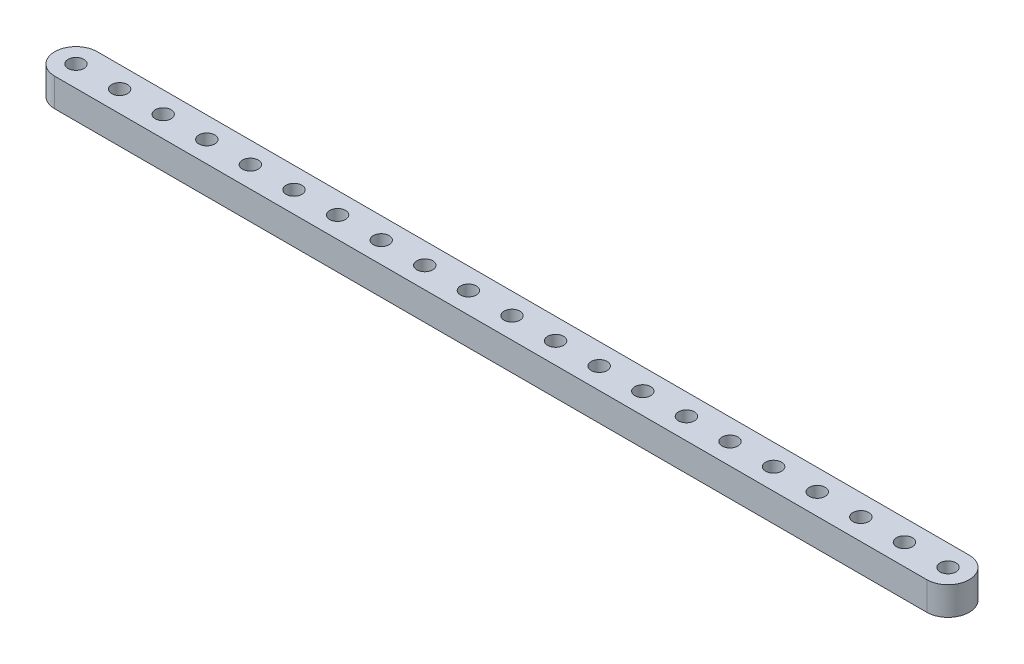
ISO-10303-21;
HEADER;
FILE_DESCRIPTION(('STEP AP214'),'2;1');
FILE_NAME('part.step','',(''),(''),'','','');
FILE_SCHEMA(('AUTOMOTIVE_DESIGN { 1 0 10303 214 1 1 1 1 }'));
ENDSEC;
DATA;
#1=APPLICATION_CONTEXT('core data for automotive mechanical design processes');
#2=APPLICATION_PROTOCOL_DEFINITION('international standard','automotive_design',2000,#1);
#3=PRODUCT_CONTEXT('',#1,'mechanical');
#4=PRODUCT('Part','Part','',(#3));
#5=PRODUCT_RELATED_PRODUCT_CATEGORY('part','',(#4));
#6=PRODUCT_DEFINITION_FORMATION('','',#4);
#7=PRODUCT_DEFINITION_CONTEXT('part definition',#1,'design');
#8=PRODUCT_DEFINITION('design','',#6,#7);
#9=PRODUCT_DEFINITION_SHAPE('','',#8);
#10=(LENGTH_UNIT() NAMED_UNIT(*) SI_UNIT(.MILLI.,.METRE.));
#11=(NAMED_UNIT(*) PLANE_ANGLE_UNIT() SI_UNIT($,.RADIAN.));
#12=(NAMED_UNIT(*) SI_UNIT($,.STERADIAN.) SOLID_ANGLE_UNIT());
#13=UNCERTAINTY_MEASURE_WITH_UNIT(LENGTH_MEASURE(1.E-05),#10,'distance_accuracy_value','');
#14=(GEOMETRIC_REPRESENTATION_CONTEXT(3) GLOBAL_UNCERTAINTY_ASSIGNED_CONTEXT((#13)) GLOBAL_UNIT_ASSIGNED_CONTEXT((#10,
#11,#12)) REPRESENTATION_CONTEXT('',''));
#15=CARTESIAN_POINT('',(0.,0.,0.));
#16=DIRECTION('',(0.,0.,1.));
#17=DIRECTION('',(1.,0.,0.));
#18=AXIS2_PLACEMENT_3D('',#15,#16,#17);
#19=CARTESIAN_POINT('',(97.79,0.,0.));
#20=DIRECTION('',(0.,1.,0.));
#21=DIRECTION('',(0.,0.,1.));
#22=AXIS2_PLACEMENT_3D('',#19,#20,#21);
#23=CYLINDRICAL_SURFACE('',#22,4.76250000000002);
#24=CARTESIAN_POINT('',(97.79,6.35,0.));
#25=DIRECTION('',(0.,1.,0.));
#26=DIRECTION('',(0.,0.,1.));
#27=AXIS2_PLACEMENT_3D('',#24,#25,#26);
#28=CIRCLE('',#27,4.76250000000002);
#29=CARTESIAN_POINT('',(97.79,6.35,4.76250000000003));
#30=VERTEX_POINT('',#29);
#31=CARTESIAN_POINT('',(97.79,6.35,-4.76250000000002));
#32=VERTEX_POINT('',#31);
#33=EDGE_CURVE('E98',#30,#32,#28,.T.);
#34=ORIENTED_EDGE('',*,*,#33,.F.);
#35=DIRECTION('',(0.,1.,0.));
#36=VECTOR('',#35,1.);
#37=CARTESIAN_POINT('',(97.79,0.,4.76250000000003));
#38=LINE('',#37,#36);
#39=CARTESIAN_POINT('',(97.79,0.,4.76250000000003));
#40=VERTEX_POINT('',#39);
#41=EDGE_CURVE('E11',#40,#30,#38,.T.);
#42=ORIENTED_EDGE('',*,*,#41,.F.);
#43=CARTESIAN_POINT('',(97.79,0.,0.));
#44=DIRECTION('',(0.,1.,0.));
#45=DIRECTION('',(0.,0.,1.));
#46=AXIS2_PLACEMENT_3D('',#43,#44,#45);
#47=CIRCLE('',#46,4.76250000000002);
#48=CARTESIAN_POINT('',(97.79,0.,-4.76250000000002));
#49=VERTEX_POINT('',#48);
#50=EDGE_CURVE('E91',#40,#49,#47,.T.);
#51=ORIENTED_EDGE('',*,*,#50,.T.);
#52=DIRECTION('',(0.,1.,0.));
#53=VECTOR('',#52,1.);
#54=CARTESIAN_POINT('',(97.79,0.,-4.76250000000002));
#55=LINE('',#54,#53);
#56=EDGE_CURVE('E36',#49,#32,#55,.T.);
#57=ORIENTED_EDGE('',*,*,#56,.T.);
#58=EDGE_LOOP('',(#34,#42,#51,#57));
#59=FACE_BOUND('',#58,.T.);
#60=ADVANCED_FACE('F33',(#59),#23,.T.);
#61=CARTESIAN_POINT('',(-97.79,0.,4.76250000000003));
#62=DIRECTION('',(0.,0.,1.));
#63=DIRECTION('',(1.,0.,0.));
#64=AXIS2_PLACEMENT_3D('',#61,#62,#63);
#65=PLANE('',#64);
#66=DIRECTION('',(1.,0.,0.));
#67=VECTOR('',#66,1.);
#68=CARTESIAN_POINT('',(-97.79,6.35,4.76250000000003));
#69=LINE('',#68,#67);
#70=CARTESIAN_POINT('',(-97.79,6.35,4.76250000000003));
#71=VERTEX_POINT('',#70);
#72=EDGE_CURVE('E93',#71,#30,#69,.T.);
#73=ORIENTED_EDGE('',*,*,#72,.F.);
#74=DIRECTION('',(0.,1.,0.));
#75=VECTOR('',#74,1.);
#76=CARTESIAN_POINT('',(-97.79,0.,4.76250000000003));
#77=LINE('',#76,#75);
#78=CARTESIAN_POINT('',(-97.79,0.,4.76250000000003));
#79=VERTEX_POINT('',#78);
#80=EDGE_CURVE('E42',#79,#71,#77,.T.);
#81=ORIENTED_EDGE('',*,*,#80,.F.);
#82=DIRECTION('',(1.,0.,0.));
#83=VECTOR('',#82,1.);
#84=CARTESIAN_POINT('',(-97.79,0.,4.76250000000003));
#85=LINE('',#84,#83);
#86=EDGE_CURVE('E88',#79,#40,#85,.T.);
#87=ORIENTED_EDGE('',*,*,#86,.T.);
#88=ORIENTED_EDGE('',*,*,#41,.T.);
#89=EDGE_LOOP('',(#73,#81,#87,#88));
#90=FACE_BOUND('',#89,.T.);
#91=ADVANCED_FACE('F109',(#90),#65,.T.);
#92=CARTESIAN_POINT('',(-97.79,0.,0.));
#93=DIRECTION('',(0.,1.,0.));
#94=DIRECTION('',(0.,0.,1.));
#95=AXIS2_PLACEMENT_3D('',#92,#93,#94);
#96=CYLINDRICAL_SURFACE('',#95,4.76250000000002);
#97=CARTESIAN_POINT('',(-97.79,6.35,0.));
#98=DIRECTION('',(0.,1.,0.));
#99=DIRECTION('',(0.,0.,1.));
#100=AXIS2_PLACEMENT_3D('',#97,#98,#99);
#101=CIRCLE('',#100,4.76250000000002);
#102=CARTESIAN_POINT('',(-97.79,6.35,-4.7625));
#103=VERTEX_POINT('',#102);
#104=EDGE_CURVE('E83',#103,#71,#101,.T.);
#105=ORIENTED_EDGE('',*,*,#104,.F.);
#106=DIRECTION('',(0.,1.,0.));
#107=VECTOR('',#106,1.);
#108=CARTESIAN_POINT('',(-97.79,0.,-4.7625));
#109=LINE('',#108,#107);
#110=CARTESIAN_POINT('',(-97.79,0.,-4.7625));
#111=VERTEX_POINT('',#110);
#112=EDGE_CURVE('E78',#111,#103,#109,.T.);
#113=ORIENTED_EDGE('',*,*,#112,.F.);
#114=CARTESIAN_POINT('',(-97.79,0.,0.));
#115=DIRECTION('',(0.,1.,0.));
#116=DIRECTION('',(0.,0.,1.));
#117=AXIS2_PLACEMENT_3D('',#114,#115,#116);
#118=CIRCLE('',#117,4.76250000000002);
#119=EDGE_CURVE('E81',#111,#79,#118,.T.);
#120=ORIENTED_EDGE('',*,*,#119,.T.);
#121=ORIENTED_EDGE('',*,*,#80,.T.);
#122=EDGE_LOOP('',(#105,#113,#120,#121));
#123=FACE_BOUND('',#122,.T.);
#124=ADVANCED_FACE('F80',(#123),#96,.T.);
#125=CARTESIAN_POINT('',(97.79,0.,-4.76250000000002));
#126=DIRECTION('',(0.,0.,-1.));
#127=DIRECTION('',(-1.,0.,0.));
#128=AXIS2_PLACEMENT_3D('',#125,#126,#127);
#129=PLANE('',#128);
#130=DIRECTION('',(-1.,0.,0.));
#131=VECTOR('',#130,1.);
#132=CARTESIAN_POINT('',(97.79,6.35,-4.76250000000002));
#133=LINE('',#132,#131);
#134=EDGE_CURVE('E101',#32,#103,#133,.T.);
#135=ORIENTED_EDGE('',*,*,#134,.F.);
#136=ORIENTED_EDGE('',*,*,#56,.F.);
#137=DIRECTION('',(-1.,0.,0.));
#138=VECTOR('',#137,1.);
#139=CARTESIAN_POINT('',(97.79,0.,-4.76250000000002));
#140=LINE('',#139,#138);
#141=EDGE_CURVE('E87',#49,#111,#140,.T.);
#142=ORIENTED_EDGE('',*,*,#141,.T.);
#143=ORIENTED_EDGE('',*,*,#112,.T.);
#144=EDGE_LOOP('',(#135,#136,#142,#143));
#145=FACE_BOUND('',#144,.T.);
#146=ADVANCED_FACE('F90',(#145),#129,.T.);
#147=CARTESIAN_POINT('',(97.79,0.,0.));
#148=DIRECTION('',(0.,1.,0.));
#149=DIRECTION('',(0.,0.,1.));
#150=AXIS2_PLACEMENT_3D('',#147,#148,#149);
#151=PLANE('',#150);
#152=CARTESIAN_POINT('',(-97.79,0.,0.));
#153=DIRECTION('',(0.,1.,0.));
#154=DIRECTION('',(0.,0.,-1.));
#155=AXIS2_PLACEMENT_3D('',#152,#153,#154);
#156=CIRCLE('',#155,1.77799999999997);
#157=CARTESIAN_POINT('',(-97.79,0.,-1.77799999999995));
#158=VERTEX_POINT('',#157);
#159=EDGE_CURVE('E218',#158,#158,#156,.T.);
#160=ORIENTED_EDGE('',*,*,#159,.T.);
#161=EDGE_LOOP('',(#160));
#162=FACE_BOUND('',#161,.T.);
#163=CARTESIAN_POINT('',(-88.011,0.,0.));
#164=DIRECTION('',(0.,1.,0.));
#165=DIRECTION('',(0.,0.,-1.));
#166=AXIS2_PLACEMENT_3D('',#163,#164,#165);
#167=CIRCLE('',#166,1.77799999999999);
#168=CARTESIAN_POINT('',(-88.011,0.,-1.77799999999999));
#169=VERTEX_POINT('',#168);
#170=EDGE_CURVE('E226',#169,#169,#167,.T.);
#171=ORIENTED_EDGE('',*,*,#170,.T.);
#172=EDGE_LOOP('',(#171));
#173=FACE_BOUND('',#172,.T.);
#174=CARTESIAN_POINT('',(-78.232,0.,0.));
#175=DIRECTION('',(0.,1.,0.));
#176=DIRECTION('',(0.,0.,-1.));
#177=AXIS2_PLACEMENT_3D('',#174,#175,#176);
#178=CIRCLE('',#177,1.77799999999999);
#179=CARTESIAN_POINT('',(-78.232,0.,-1.77799999999999));
#180=VERTEX_POINT('',#179);
#181=EDGE_CURVE('E232',#180,#180,#178,.T.);
#182=ORIENTED_EDGE('',*,*,#181,.T.);
#183=EDGE_LOOP('',(#182));
#184=FACE_BOUND('',#183,.T.);
#185=CARTESIAN_POINT('',(-68.453,0.,0.));
#186=DIRECTION('',(0.,1.,0.));
#187=DIRECTION('',(0.,0.,-1.));
#188=AXIS2_PLACEMENT_3D('',#185,#186,#187);
#189=CIRCLE('',#188,1.77799999999999);
#190=CARTESIAN_POINT('',(-68.453,0.,-1.77799999999999));
#191=VERTEX_POINT('',#190);
#192=EDGE_CURVE('E238',#191,#191,#189,.T.);
#193=ORIENTED_EDGE('',*,*,#192,.T.);
#194=EDGE_LOOP('',(#193));
#195=FACE_BOUND('',#194,.T.);
#196=CARTESIAN_POINT('',(-58.674,0.,0.));
#197=DIRECTION('',(0.,1.,0.));
#198=DIRECTION('',(0.,0.,-1.));
#199=AXIS2_PLACEMENT_3D('',#196,#197,#198);
#200=CIRCLE('',#199,1.77799999999999);
#201=CARTESIAN_POINT('',(-58.674,0.,-1.77799999999998));
#202=VERTEX_POINT('',#201);
#203=EDGE_CURVE('E244',#202,#202,#200,.T.);
#204=ORIENTED_EDGE('',*,*,#203,.T.);
#205=EDGE_LOOP('',(#204));
#206=FACE_BOUND('',#205,.T.);
#207=CARTESIAN_POINT('',(-48.895,0.,0.));
#208=DIRECTION('',(0.,1.,0.));
#209=DIRECTION('',(0.,0.,-1.));
#210=AXIS2_PLACEMENT_3D('',#207,#208,#209);
#211=CIRCLE('',#210,1.77799999999999);
#212=CARTESIAN_POINT('',(-48.895,0.,-1.77799999999998));
#213=VERTEX_POINT('',#212);
#214=EDGE_CURVE('E250',#213,#213,#211,.T.);
#215=ORIENTED_EDGE('',*,*,#214,.T.);
#216=EDGE_LOOP('',(#215));
#217=FACE_BOUND('',#216,.T.);
#218=CARTESIAN_POINT('',(-39.116,0.,0.));
#219=DIRECTION('',(0.,1.,0.));
#220=DIRECTION('',(0.,0.,-1.));
#221=AXIS2_PLACEMENT_3D('',#218,#219,#220);
#222=CIRCLE('',#221,1.77799999999999);
#223=CARTESIAN_POINT('',(-39.116,0.,-1.77799999999998));
#224=VERTEX_POINT('',#223);
#225=EDGE_CURVE('E256',#224,#224,#222,.T.);
#226=ORIENTED_EDGE('',*,*,#225,.T.);
#227=EDGE_LOOP('',(#226));
#228=FACE_BOUND('',#227,.T.);
#229=CARTESIAN_POINT('',(-29.337,0.,0.));
#230=DIRECTION('',(0.,1.,0.));
#231=DIRECTION('',(0.,0.,-1.));
#232=AXIS2_PLACEMENT_3D('',#229,#230,#231);
#233=CIRCLE('',#232,1.77799999999999);
#234=CARTESIAN_POINT('',(-29.337,0.,-1.77799999999998));
#235=VERTEX_POINT('',#234);
#236=EDGE_CURVE('E262',#235,#235,#233,.T.);
#237=ORIENTED_EDGE('',*,*,#236,.T.);
#238=EDGE_LOOP('',(#237));
#239=FACE_BOUND('',#238,.T.);
#240=CARTESIAN_POINT('',(-19.558,0.,0.));
#241=DIRECTION('',(0.,1.,0.));
#242=DIRECTION('',(0.,0.,-1.));
#243=AXIS2_PLACEMENT_3D('',#240,#241,#242);
#244=CIRCLE('',#243,1.77799999999999);
#245=CARTESIAN_POINT('',(-19.558,0.,-1.77799999999998));
#246=VERTEX_POINT('',#245);
#247=EDGE_CURVE('E268',#246,#246,#244,.T.);
#248=ORIENTED_EDGE('',*,*,#247,.T.);
#249=EDGE_LOOP('',(#248));
#250=FACE_BOUND('',#249,.T.);
#251=CARTESIAN_POINT('',(-9.77900000000001,0.,0.));
#252=DIRECTION('',(0.,1.,0.));
#253=DIRECTION('',(0.,0.,-1.));
#254=AXIS2_PLACEMENT_3D('',#251,#252,#253);
#255=CIRCLE('',#254,1.77799999999999);
#256=CARTESIAN_POINT('',(-9.77900000000001,0.,-1.77799999999998));
#257=VERTEX_POINT('',#256);
#258=EDGE_CURVE('E274',#257,#257,#255,.T.);
#259=ORIENTED_EDGE('',*,*,#258,.T.);
#260=EDGE_LOOP('',(#259));
#261=FACE_BOUND('',#260,.T.);
#262=CARTESIAN_POINT('',(0.,0.,0.));
#263=DIRECTION('',(0.,1.,0.));
#264=DIRECTION('',(0.,0.,-1.));
#265=AXIS2_PLACEMENT_3D('',#262,#263,#264);
#266=CIRCLE('',#265,1.77799999999999);
#267=CARTESIAN_POINT('',(0.,0.,-1.77799999999998));
#268=VERTEX_POINT('',#267);
#269=EDGE_CURVE('E280',#268,#268,#266,.T.);
#270=ORIENTED_EDGE('',*,*,#269,.T.);
#271=EDGE_LOOP('',(#270));
#272=FACE_BOUND('',#271,.T.);
#273=CARTESIAN_POINT('',(9.779,0.,0.));
#274=DIRECTION('',(0.,1.,0.));
#275=DIRECTION('',(0.,0.,-1.));
#276=AXIS2_PLACEMENT_3D('',#273,#274,#275);
#277=CIRCLE('',#276,1.77799999999999);
#278=CARTESIAN_POINT('',(9.779,0.,-1.77799999999998));
#279=VERTEX_POINT('',#278);
#280=EDGE_CURVE('E286',#279,#279,#277,.T.);
#281=ORIENTED_EDGE('',*,*,#280,.T.);
#282=EDGE_LOOP('',(#281));
#283=FACE_BOUND('',#282,.T.);
#284=CARTESIAN_POINT('',(19.558,0.,0.));
#285=DIRECTION('',(0.,1.,0.));
#286=DIRECTION('',(0.,0.,-1.));
#287=AXIS2_PLACEMENT_3D('',#284,#285,#286);
#288=CIRCLE('',#287,1.77799999999999);
#289=CARTESIAN_POINT('',(19.558,0.,-1.77799999999998));
#290=VERTEX_POINT('',#289);
#291=EDGE_CURVE('E292',#290,#290,#288,.T.);
#292=ORIENTED_EDGE('',*,*,#291,.T.);
#293=EDGE_LOOP('',(#292));
#294=FACE_BOUND('',#293,.T.);
#295=CARTESIAN_POINT('',(29.337,0.,0.));
#296=DIRECTION('',(0.,1.,0.));
#297=DIRECTION('',(0.,0.,-1.));
#298=AXIS2_PLACEMENT_3D('',#295,#296,#297);
#299=CIRCLE('',#298,1.77799999999999);
#300=CARTESIAN_POINT('',(29.337,0.,-1.77799999999998));
#301=VERTEX_POINT('',#300);
#302=EDGE_CURVE('E298',#301,#301,#299,.T.);
#303=ORIENTED_EDGE('',*,*,#302,.T.);
#304=EDGE_LOOP('',(#303));
#305=FACE_BOUND('',#304,.T.);
#306=CARTESIAN_POINT('',(39.116,0.,0.));
#307=DIRECTION('',(0.,1.,0.));
#308=DIRECTION('',(0.,0.,-1.));
#309=AXIS2_PLACEMENT_3D('',#306,#307,#308);
#310=CIRCLE('',#309,1.77799999999999);
#311=CARTESIAN_POINT('',(39.116,0.,-1.77799999999998));
#312=VERTEX_POINT('',#311);
#313=EDGE_CURVE('E304',#312,#312,#310,.T.);
#314=ORIENTED_EDGE('',*,*,#313,.T.);
#315=EDGE_LOOP('',(#314));
#316=FACE_BOUND('',#315,.T.);
#317=CARTESIAN_POINT('',(48.895,0.,0.));
#318=DIRECTION('',(0.,1.,0.));
#319=DIRECTION('',(0.,0.,-1.));
#320=AXIS2_PLACEMENT_3D('',#317,#318,#319);
#321=CIRCLE('',#320,1.77799999999999);
#322=CARTESIAN_POINT('',(48.895,0.,-1.77799999999997));
#323=VERTEX_POINT('',#322);
#324=EDGE_CURVE('E310',#323,#323,#321,.T.);
#325=ORIENTED_EDGE('',*,*,#324,.T.);
#326=EDGE_LOOP('',(#325));
#327=FACE_BOUND('',#326,.T.);
#328=CARTESIAN_POINT('',(58.674,0.,0.));
#329=DIRECTION('',(0.,1.,0.));
#330=DIRECTION('',(0.,0.,-1.));
#331=AXIS2_PLACEMENT_3D('',#328,#329,#330);
#332=CIRCLE('',#331,1.77799999999999);
#333=CARTESIAN_POINT('',(58.674,0.,-1.77799999999997));
#334=VERTEX_POINT('',#333);
#335=EDGE_CURVE('E316',#334,#334,#332,.T.);
#336=ORIENTED_EDGE('',*,*,#335,.T.);
#337=EDGE_LOOP('',(#336));
#338=FACE_BOUND('',#337,.T.);
#339=CARTESIAN_POINT('',(68.453,0.,0.));
#340=DIRECTION('',(0.,1.,0.));
#341=DIRECTION('',(0.,0.,-1.));
#342=AXIS2_PLACEMENT_3D('',#339,#340,#341);
#343=CIRCLE('',#342,1.77799999999999);
#344=CARTESIAN_POINT('',(68.453,0.,-1.77799999999997));
#345=VERTEX_POINT('',#344);
#346=EDGE_CURVE('E322',#345,#345,#343,.T.);
#347=ORIENTED_EDGE('',*,*,#346,.T.);
#348=EDGE_LOOP('',(#347));
#349=FACE_BOUND('',#348,.T.);
#350=CARTESIAN_POINT('',(78.232,0.,0.));
#351=DIRECTION('',(0.,1.,0.));
#352=DIRECTION('',(0.,0.,-1.));
#353=AXIS2_PLACEMENT_3D('',#350,#351,#352);
#354=CIRCLE('',#353,1.77799999999999);
#355=CARTESIAN_POINT('',(78.232,0.,-1.77799999999997));
#356=VERTEX_POINT('',#355);
#357=EDGE_CURVE('E328',#356,#356,#354,.T.);
#358=ORIENTED_EDGE('',*,*,#357,.T.);
#359=EDGE_LOOP('',(#358));
#360=FACE_BOUND('',#359,.T.);
#361=CARTESIAN_POINT('',(88.011,0.,0.));
#362=DIRECTION('',(0.,1.,0.));
#363=DIRECTION('',(0.,0.,-1.));
#364=AXIS2_PLACEMENT_3D('',#361,#362,#363);
#365=CIRCLE('',#364,1.77799999999999);
#366=CARTESIAN_POINT('',(88.011,0.,-1.77799999999997));
#367=VERTEX_POINT('',#366);
#368=EDGE_CURVE('E334',#367,#367,#365,.T.);
#369=ORIENTED_EDGE('',*,*,#368,.T.);
#370=EDGE_LOOP('',(#369));
#371=FACE_BOUND('',#370,.T.);
#372=CARTESIAN_POINT('',(97.79,0.,0.));
#373=DIRECTION('',(0.,1.,0.));
#374=DIRECTION('',(0.,0.,-1.));
#375=AXIS2_PLACEMENT_3D('',#372,#373,#374);
#376=CIRCLE('',#375,1.77799999999999);
#377=CARTESIAN_POINT('',(97.79,0.,-1.77799999999997));
#378=VERTEX_POINT('',#377);
#379=EDGE_CURVE('E102',#378,#378,#376,.T.);
#380=ORIENTED_EDGE('',*,*,#379,.T.);
#381=EDGE_LOOP('',(#380));
#382=FACE_BOUND('',#381,.T.);
#383=ORIENTED_EDGE('',*,*,#50,.F.);
#384=ORIENTED_EDGE('',*,*,#86,.F.);
#385=ORIENTED_EDGE('',*,*,#119,.F.);
#386=ORIENTED_EDGE('',*,*,#141,.F.);
#387=EDGE_LOOP('',(#383,#384,#385,#386));
#388=FACE_BOUND('',#387,.T.);
#389=ADVANCED_FACE('F86',(#162,#173,#184,#195,#206,#217,#228,#239,#250,#261,#272,#283,#294,#305,
#316,#327,#338,#349,#360,#371,#382,#388),#151,.F.);
#390=CARTESIAN_POINT('',(97.79,6.35,0.));
#391=DIRECTION('',(0.,1.,0.));
#392=DIRECTION('',(0.,0.,1.));
#393=AXIS2_PLACEMENT_3D('',#390,#391,#392);
#394=PLANE('',#393);
#395=CARTESIAN_POINT('',(-97.79,6.35,0.));
#396=DIRECTION('',(0.,1.,0.));
#397=DIRECTION('',(0.,0.,-1.));
#398=AXIS2_PLACEMENT_3D('',#395,#396,#397);
#399=CIRCLE('',#398,1.77799999999997);
#400=CARTESIAN_POINT('',(-97.79,6.35,-1.77799999999995));
#401=VERTEX_POINT('',#400);
#402=EDGE_CURVE('E221',#401,#401,#399,.T.);
#403=ORIENTED_EDGE('',*,*,#402,.F.);
#404=EDGE_LOOP('',(#403));
#405=FACE_BOUND('',#404,.T.);
#406=CARTESIAN_POINT('',(-88.011,6.35,0.));
#407=DIRECTION('',(0.,1.,0.));
#408=DIRECTION('',(0.,0.,-1.));
#409=AXIS2_PLACEMENT_3D('',#406,#407,#408);
#410=CIRCLE('',#409,1.77799999999999);
#411=CARTESIAN_POINT('',(-88.011,6.35,-1.77799999999999));
#412=VERTEX_POINT('',#411);
#413=EDGE_CURVE('E223',#412,#412,#410,.T.);
#414=ORIENTED_EDGE('',*,*,#413,.F.);
#415=EDGE_LOOP('',(#414));
#416=FACE_BOUND('',#415,.T.);
#417=CARTESIAN_POINT('',(-78.232,6.35,0.));
#418=DIRECTION('',(0.,1.,0.));
#419=DIRECTION('',(0.,0.,-1.));
#420=AXIS2_PLACEMENT_3D('',#417,#418,#419);
#421=CIRCLE('',#420,1.77799999999999);
#422=CARTESIAN_POINT('',(-78.232,6.35,-1.77799999999999));
#423=VERTEX_POINT('',#422);
#424=EDGE_CURVE('E229',#423,#423,#421,.T.);
#425=ORIENTED_EDGE('',*,*,#424,.F.);
#426=EDGE_LOOP('',(#425));
#427=FACE_BOUND('',#426,.T.);
#428=CARTESIAN_POINT('',(-68.453,6.35,0.));
#429=DIRECTION('',(0.,1.,0.));
#430=DIRECTION('',(0.,0.,-1.));
#431=AXIS2_PLACEMENT_3D('',#428,#429,#430);
#432=CIRCLE('',#431,1.77799999999999);
#433=CARTESIAN_POINT('',(-68.453,6.35,-1.77799999999999));
#434=VERTEX_POINT('',#433);
#435=EDGE_CURVE('E235',#434,#434,#432,.T.);
#436=ORIENTED_EDGE('',*,*,#435,.F.);
#437=EDGE_LOOP('',(#436));
#438=FACE_BOUND('',#437,.T.);
#439=CARTESIAN_POINT('',(-58.674,6.35,0.));
#440=DIRECTION('',(0.,1.,0.));
#441=DIRECTION('',(0.,0.,-1.));
#442=AXIS2_PLACEMENT_3D('',#439,#440,#441);
#443=CIRCLE('',#442,1.77799999999999);
#444=CARTESIAN_POINT('',(-58.674,6.35,-1.77799999999998));
#445=VERTEX_POINT('',#444);
#446=EDGE_CURVE('E241',#445,#445,#443,.T.);
#447=ORIENTED_EDGE('',*,*,#446,.F.);
#448=EDGE_LOOP('',(#447));
#449=FACE_BOUND('',#448,.T.);
#450=CARTESIAN_POINT('',(-48.895,6.35,0.));
#451=DIRECTION('',(0.,1.,0.));
#452=DIRECTION('',(0.,0.,-1.));
#453=AXIS2_PLACEMENT_3D('',#450,#451,#452);
#454=CIRCLE('',#453,1.77799999999999);
#455=CARTESIAN_POINT('',(-48.895,6.35,-1.77799999999998));
#456=VERTEX_POINT('',#455);
#457=EDGE_CURVE('E247',#456,#456,#454,.T.);
#458=ORIENTED_EDGE('',*,*,#457,.F.);
#459=EDGE_LOOP('',(#458));
#460=FACE_BOUND('',#459,.T.);
#461=CARTESIAN_POINT('',(-39.116,6.35,0.));
#462=DIRECTION('',(0.,1.,0.));
#463=DIRECTION('',(0.,0.,-1.));
#464=AXIS2_PLACEMENT_3D('',#461,#462,#463);
#465=CIRCLE('',#464,1.77799999999999);
#466=CARTESIAN_POINT('',(-39.116,6.35,-1.77799999999998));
#467=VERTEX_POINT('',#466);
#468=EDGE_CURVE('E253',#467,#467,#465,.T.);
#469=ORIENTED_EDGE('',*,*,#468,.F.);
#470=EDGE_LOOP('',(#469));
#471=FACE_BOUND('',#470,.T.);
#472=CARTESIAN_POINT('',(-29.337,6.35,0.));
#473=DIRECTION('',(0.,1.,0.));
#474=DIRECTION('',(0.,0.,-1.));
#475=AXIS2_PLACEMENT_3D('',#472,#473,#474);
#476=CIRCLE('',#475,1.77799999999999);
#477=CARTESIAN_POINT('',(-29.337,6.35,-1.77799999999998));
#478=VERTEX_POINT('',#477);
#479=EDGE_CURVE('E259',#478,#478,#476,.T.);
#480=ORIENTED_EDGE('',*,*,#479,.F.);
#481=EDGE_LOOP('',(#480));
#482=FACE_BOUND('',#481,.T.);
#483=CARTESIAN_POINT('',(-19.558,6.35,0.));
#484=DIRECTION('',(0.,1.,0.));
#485=DIRECTION('',(0.,0.,-1.));
#486=AXIS2_PLACEMENT_3D('',#483,#484,#485);
#487=CIRCLE('',#486,1.77799999999999);
#488=CARTESIAN_POINT('',(-19.558,6.35,-1.77799999999998));
#489=VERTEX_POINT('',#488);
#490=EDGE_CURVE('E265',#489,#489,#487,.T.);
#491=ORIENTED_EDGE('',*,*,#490,.F.);
#492=EDGE_LOOP('',(#491));
#493=FACE_BOUND('',#492,.T.);
#494=CARTESIAN_POINT('',(-9.77900000000001,6.35,0.));
#495=DIRECTION('',(0.,1.,0.));
#496=DIRECTION('',(0.,0.,-1.));
#497=AXIS2_PLACEMENT_3D('',#494,#495,#496);
#498=CIRCLE('',#497,1.77799999999999);
#499=CARTESIAN_POINT('',(-9.77900000000001,6.35,-1.77799999999998));
#500=VERTEX_POINT('',#499);
#501=EDGE_CURVE('E271',#500,#500,#498,.T.);
#502=ORIENTED_EDGE('',*,*,#501,.F.);
#503=EDGE_LOOP('',(#502));
#504=FACE_BOUND('',#503,.T.);
#505=CARTESIAN_POINT('',(0.,6.35,0.));
#506=DIRECTION('',(0.,1.,0.));
#507=DIRECTION('',(0.,0.,-1.));
#508=AXIS2_PLACEMENT_3D('',#505,#506,#507);
#509=CIRCLE('',#508,1.77799999999999);
#510=CARTESIAN_POINT('',(0.,6.35,-1.77799999999998));
#511=VERTEX_POINT('',#510);
#512=EDGE_CURVE('E277',#511,#511,#509,.T.);
#513=ORIENTED_EDGE('',*,*,#512,.F.);
#514=EDGE_LOOP('',(#513));
#515=FACE_BOUND('',#514,.T.);
#516=CARTESIAN_POINT('',(9.779,6.35,0.));
#517=DIRECTION('',(0.,1.,0.));
#518=DIRECTION('',(0.,0.,-1.));
#519=AXIS2_PLACEMENT_3D('',#516,#517,#518);
#520=CIRCLE('',#519,1.77799999999999);
#521=CARTESIAN_POINT('',(9.779,6.35,-1.77799999999998));
#522=VERTEX_POINT('',#521);
#523=EDGE_CURVE('E283',#522,#522,#520,.T.);
#524=ORIENTED_EDGE('',*,*,#523,.F.);
#525=EDGE_LOOP('',(#524));
#526=FACE_BOUND('',#525,.T.);
#527=CARTESIAN_POINT('',(19.558,6.35,0.));
#528=DIRECTION('',(0.,1.,0.));
#529=DIRECTION('',(0.,0.,-1.));
#530=AXIS2_PLACEMENT_3D('',#527,#528,#529);
#531=CIRCLE('',#530,1.77799999999999);
#532=CARTESIAN_POINT('',(19.558,6.35,-1.77799999999998));
#533=VERTEX_POINT('',#532);
#534=EDGE_CURVE('E289',#533,#533,#531,.T.);
#535=ORIENTED_EDGE('',*,*,#534,.F.);
#536=EDGE_LOOP('',(#535));
#537=FACE_BOUND('',#536,.T.);
#538=CARTESIAN_POINT('',(29.337,6.35,0.));
#539=DIRECTION('',(0.,1.,0.));
#540=DIRECTION('',(0.,0.,-1.));
#541=AXIS2_PLACEMENT_3D('',#538,#539,#540);
#542=CIRCLE('',#541,1.77799999999999);
#543=CARTESIAN_POINT('',(29.337,6.35,-1.77799999999998));
#544=VERTEX_POINT('',#543);
#545=EDGE_CURVE('E295',#544,#544,#542,.T.);
#546=ORIENTED_EDGE('',*,*,#545,.F.);
#547=EDGE_LOOP('',(#546));
#548=FACE_BOUND('',#547,.T.);
#549=CARTESIAN_POINT('',(39.116,6.35,0.));
#550=DIRECTION('',(0.,1.,0.));
#551=DIRECTION('',(0.,0.,-1.));
#552=AXIS2_PLACEMENT_3D('',#549,#550,#551);
#553=CIRCLE('',#552,1.77799999999999);
#554=CARTESIAN_POINT('',(39.116,6.35,-1.77799999999998));
#555=VERTEX_POINT('',#554);
#556=EDGE_CURVE('E301',#555,#555,#553,.T.);
#557=ORIENTED_EDGE('',*,*,#556,.F.);
#558=EDGE_LOOP('',(#557));
#559=FACE_BOUND('',#558,.T.);
#560=CARTESIAN_POINT('',(48.895,6.35,0.));
#561=DIRECTION('',(0.,1.,0.));
#562=DIRECTION('',(0.,0.,-1.));
#563=AXIS2_PLACEMENT_3D('',#560,#561,#562);
#564=CIRCLE('',#563,1.77799999999999);
#565=CARTESIAN_POINT('',(48.895,6.35,-1.77799999999997));
#566=VERTEX_POINT('',#565);
#567=EDGE_CURVE('E307',#566,#566,#564,.T.);
#568=ORIENTED_EDGE('',*,*,#567,.F.);
#569=EDGE_LOOP('',(#568));
#570=FACE_BOUND('',#569,.T.);
#571=CARTESIAN_POINT('',(58.674,6.35,0.));
#572=DIRECTION('',(0.,1.,0.));
#573=DIRECTION('',(0.,0.,-1.));
#574=AXIS2_PLACEMENT_3D('',#571,#572,#573);
#575=CIRCLE('',#574,1.77799999999999);
#576=CARTESIAN_POINT('',(58.674,6.35,-1.77799999999997));
#577=VERTEX_POINT('',#576);
#578=EDGE_CURVE('E313',#577,#577,#575,.T.);
#579=ORIENTED_EDGE('',*,*,#578,.F.);
#580=EDGE_LOOP('',(#579));
#581=FACE_BOUND('',#580,.T.);
#582=CARTESIAN_POINT('',(68.453,6.35,0.));
#583=DIRECTION('',(0.,1.,0.));
#584=DIRECTION('',(0.,0.,-1.));
#585=AXIS2_PLACEMENT_3D('',#582,#583,#584);
#586=CIRCLE('',#585,1.77799999999999);
#587=CARTESIAN_POINT('',(68.453,6.35,-1.77799999999997));
#588=VERTEX_POINT('',#587);
#589=EDGE_CURVE('E319',#588,#588,#586,.T.);
#590=ORIENTED_EDGE('',*,*,#589,.F.);
#591=EDGE_LOOP('',(#590));
#592=FACE_BOUND('',#591,.T.);
#593=CARTESIAN_POINT('',(78.232,6.35,0.));
#594=DIRECTION('',(0.,1.,0.));
#595=DIRECTION('',(0.,0.,-1.));
#596=AXIS2_PLACEMENT_3D('',#593,#594,#595);
#597=CIRCLE('',#596,1.77799999999999);
#598=CARTESIAN_POINT('',(78.232,6.35,-1.77799999999997));
#599=VERTEX_POINT('',#598);
#600=EDGE_CURVE('E325',#599,#599,#597,.T.);
#601=ORIENTED_EDGE('',*,*,#600,.F.);
#602=EDGE_LOOP('',(#601));
#603=FACE_BOUND('',#602,.T.);
#604=CARTESIAN_POINT('',(88.011,6.35,0.));
#605=DIRECTION('',(0.,1.,0.));
#606=DIRECTION('',(0.,0.,-1.));
#607=AXIS2_PLACEMENT_3D('',#604,#605,#606);
#608=CIRCLE('',#607,1.77799999999999);
#609=CARTESIAN_POINT('',(88.011,6.35,-1.77799999999997));
#610=VERTEX_POINT('',#609);
#611=EDGE_CURVE('E331',#610,#610,#608,.T.);
#612=ORIENTED_EDGE('',*,*,#611,.F.);
#613=EDGE_LOOP('',(#612));
#614=FACE_BOUND('',#613,.T.);
#615=CARTESIAN_POINT('',(97.79,6.35,0.));
#616=DIRECTION('',(0.,1.,0.));
#617=DIRECTION('',(0.,0.,-1.));
#618=AXIS2_PLACEMENT_3D('',#615,#616,#617);
#619=CIRCLE('',#618,1.77799999999999);
#620=CARTESIAN_POINT('',(97.79,6.35,-1.77799999999997));
#621=VERTEX_POINT('',#620);
#622=EDGE_CURVE('E337',#621,#621,#619,.T.);
#623=ORIENTED_EDGE('',*,*,#622,.F.);
#624=EDGE_LOOP('',(#623));
#625=FACE_BOUND('',#624,.T.);
#626=ORIENTED_EDGE('',*,*,#33,.T.);
#627=ORIENTED_EDGE('',*,*,#134,.T.);
#628=ORIENTED_EDGE('',*,*,#104,.T.);
#629=ORIENTED_EDGE('',*,*,#72,.T.);
#630=EDGE_LOOP('',(#626,#627,#628,#629));
#631=FACE_BOUND('',#630,.T.);
#632=ADVANCED_FACE('F108',(#405,#416,#427,#438,#449,#460,#471,#482,#493,#504,#515,#526,#537,
#548,#559,#570,#581,#592,#603,#614,#625,#631),#394,.T.);
#633=CARTESIAN_POINT('',(97.79,0.,0.));
#634=DIRECTION('',(0.,1.,0.));
#635=DIRECTION('',(0.,0.,1.));
#636=AXIS2_PLACEMENT_3D('',#633,#634,#635);
#637=CYLINDRICAL_SURFACE('',#636,1.77799999999999);
#638=ORIENTED_EDGE('',*,*,#379,.F.);
#639=EDGE_LOOP('',(#638));
#640=FACE_BOUND('',#639,.T.);
#641=ORIENTED_EDGE('',*,*,#622,.T.);
#642=EDGE_LOOP('',(#641));
#643=FACE_BOUND('',#642,.T.);
#644=ADVANCED_FACE('F127',(#640,#643),#637,.F.);
#645=CARTESIAN_POINT('',(88.011,0.,0.));
#646=DIRECTION('',(0.,1.,0.));
#647=DIRECTION('',(0.,0.,1.));
#648=AXIS2_PLACEMENT_3D('',#645,#646,#647);
#649=CYLINDRICAL_SURFACE('',#648,1.77799999999999);
#650=ORIENTED_EDGE('',*,*,#368,.F.);
#651=EDGE_LOOP('',(#650));
#652=FACE_BOUND('',#651,.T.);
#653=ORIENTED_EDGE('',*,*,#611,.T.);
#654=EDGE_LOOP('',(#653));
#655=FACE_BOUND('',#654,.T.);
#656=ADVANCED_FACE('F134',(#652,#655),#649,.F.);
#657=CARTESIAN_POINT('',(78.232,0.,0.));
#658=DIRECTION('',(0.,1.,0.));
#659=DIRECTION('',(0.,0.,1.));
#660=AXIS2_PLACEMENT_3D('',#657,#658,#659);
#661=CYLINDRICAL_SURFACE('',#660,1.77799999999999);
#662=ORIENTED_EDGE('',*,*,#357,.F.);
#663=EDGE_LOOP('',(#662));
#664=FACE_BOUND('',#663,.T.);
#665=ORIENTED_EDGE('',*,*,#600,.T.);
#666=EDGE_LOOP('',(#665));
#667=FACE_BOUND('',#666,.T.);
#668=ADVANCED_FACE('F138',(#664,#667),#661,.F.);
#669=CARTESIAN_POINT('',(68.453,0.,0.));
#670=DIRECTION('',(0.,1.,0.));
#671=DIRECTION('',(0.,0.,1.));
#672=AXIS2_PLACEMENT_3D('',#669,#670,#671);
#673=CYLINDRICAL_SURFACE('',#672,1.77799999999999);
#674=ORIENTED_EDGE('',*,*,#346,.F.);
#675=EDGE_LOOP('',(#674));
#676=FACE_BOUND('',#675,.T.);
#677=ORIENTED_EDGE('',*,*,#589,.T.);
#678=EDGE_LOOP('',(#677));
#679=FACE_BOUND('',#678,.T.);
#680=ADVANCED_FACE('F142',(#676,#679),#673,.F.);
#681=CARTESIAN_POINT('',(58.674,0.,0.));
#682=DIRECTION('',(0.,1.,0.));
#683=DIRECTION('',(0.,0.,1.));
#684=AXIS2_PLACEMENT_3D('',#681,#682,#683);
#685=CYLINDRICAL_SURFACE('',#684,1.77799999999999);
#686=ORIENTED_EDGE('',*,*,#335,.F.);
#687=EDGE_LOOP('',(#686));
#688=FACE_BOUND('',#687,.T.);
#689=ORIENTED_EDGE('',*,*,#578,.T.);
#690=EDGE_LOOP('',(#689));
#691=FACE_BOUND('',#690,.T.);
#692=ADVANCED_FACE('F146',(#688,#691),#685,.F.);
#693=CARTESIAN_POINT('',(48.895,0.,0.));
#694=DIRECTION('',(0.,1.,0.));
#695=DIRECTION('',(0.,0.,1.));
#696=AXIS2_PLACEMENT_3D('',#693,#694,#695);
#697=CYLINDRICAL_SURFACE('',#696,1.77799999999999);
#698=ORIENTED_EDGE('',*,*,#324,.F.);
#699=EDGE_LOOP('',(#698));
#700=FACE_BOUND('',#699,.T.);
#701=ORIENTED_EDGE('',*,*,#567,.T.);
#702=EDGE_LOOP('',(#701));
#703=FACE_BOUND('',#702,.T.);
#704=ADVANCED_FACE('F150',(#700,#703),#697,.F.);
#705=CARTESIAN_POINT('',(39.116,0.,0.));
#706=DIRECTION('',(0.,1.,0.));
#707=DIRECTION('',(0.,0.,1.));
#708=AXIS2_PLACEMENT_3D('',#705,#706,#707);
#709=CYLINDRICAL_SURFACE('',#708,1.77799999999999);
#710=ORIENTED_EDGE('',*,*,#313,.F.);
#711=EDGE_LOOP('',(#710));
#712=FACE_BOUND('',#711,.T.);
#713=ORIENTED_EDGE('',*,*,#556,.T.);
#714=EDGE_LOOP('',(#713));
#715=FACE_BOUND('',#714,.T.);
#716=ADVANCED_FACE('F154',(#712,#715),#709,.F.);
#717=CARTESIAN_POINT('',(29.337,0.,0.));
#718=DIRECTION('',(0.,1.,0.));
#719=DIRECTION('',(0.,0.,1.));
#720=AXIS2_PLACEMENT_3D('',#717,#718,#719);
#721=CYLINDRICAL_SURFACE('',#720,1.77799999999999);
#722=ORIENTED_EDGE('',*,*,#302,.F.);
#723=EDGE_LOOP('',(#722));
#724=FACE_BOUND('',#723,.T.);
#725=ORIENTED_EDGE('',*,*,#545,.T.);
#726=EDGE_LOOP('',(#725));
#727=FACE_BOUND('',#726,.T.);
#728=ADVANCED_FACE('F158',(#724,#727),#721,.F.);
#729=CARTESIAN_POINT('',(19.558,0.,0.));
#730=DIRECTION('',(0.,1.,0.));
#731=DIRECTION('',(0.,0.,1.));
#732=AXIS2_PLACEMENT_3D('',#729,#730,#731);
#733=CYLINDRICAL_SURFACE('',#732,1.77799999999999);
#734=ORIENTED_EDGE('',*,*,#291,.F.);
#735=EDGE_LOOP('',(#734));
#736=FACE_BOUND('',#735,.T.);
#737=ORIENTED_EDGE('',*,*,#534,.T.);
#738=EDGE_LOOP('',(#737));
#739=FACE_BOUND('',#738,.T.);
#740=ADVANCED_FACE('F162',(#736,#739),#733,.F.);
#741=CARTESIAN_POINT('',(9.779,0.,0.));
#742=DIRECTION('',(0.,1.,0.));
#743=DIRECTION('',(0.,0.,1.));
#744=AXIS2_PLACEMENT_3D('',#741,#742,#743);
#745=CYLINDRICAL_SURFACE('',#744,1.77799999999999);
#746=ORIENTED_EDGE('',*,*,#280,.F.);
#747=EDGE_LOOP('',(#746));
#748=FACE_BOUND('',#747,.T.);
#749=ORIENTED_EDGE('',*,*,#523,.T.);
#750=EDGE_LOOP('',(#749));
#751=FACE_BOUND('',#750,.T.);
#752=ADVANCED_FACE('F166',(#748,#751),#745,.F.);
#753=CARTESIAN_POINT('',(0.,0.,0.));
#754=DIRECTION('',(0.,1.,0.));
#755=DIRECTION('',(0.,0.,1.));
#756=AXIS2_PLACEMENT_3D('',#753,#754,#755);
#757=CYLINDRICAL_SURFACE('',#756,1.77799999999999);
#758=ORIENTED_EDGE('',*,*,#269,.F.);
#759=EDGE_LOOP('',(#758));
#760=FACE_BOUND('',#759,.T.);
#761=ORIENTED_EDGE('',*,*,#512,.T.);
#762=EDGE_LOOP('',(#761));
#763=FACE_BOUND('',#762,.T.);
#764=ADVANCED_FACE('F170',(#760,#763),#757,.F.);
#765=CARTESIAN_POINT('',(-9.77900000000001,0.,0.));
#766=DIRECTION('',(0.,1.,0.));
#767=DIRECTION('',(0.,0.,1.));
#768=AXIS2_PLACEMENT_3D('',#765,#766,#767);
#769=CYLINDRICAL_SURFACE('',#768,1.77799999999999);
#770=ORIENTED_EDGE('',*,*,#258,.F.);
#771=EDGE_LOOP('',(#770));
#772=FACE_BOUND('',#771,.T.);
#773=ORIENTED_EDGE('',*,*,#501,.T.);
#774=EDGE_LOOP('',(#773));
#775=FACE_BOUND('',#774,.T.);
#776=ADVANCED_FACE('F174',(#772,#775),#769,.F.);
#777=CARTESIAN_POINT('',(-19.558,0.,0.));
#778=DIRECTION('',(0.,1.,0.));
#779=DIRECTION('',(0.,0.,1.));
#780=AXIS2_PLACEMENT_3D('',#777,#778,#779);
#781=CYLINDRICAL_SURFACE('',#780,1.77799999999999);
#782=ORIENTED_EDGE('',*,*,#247,.F.);
#783=EDGE_LOOP('',(#782));
#784=FACE_BOUND('',#783,.T.);
#785=ORIENTED_EDGE('',*,*,#490,.T.);
#786=EDGE_LOOP('',(#785));
#787=FACE_BOUND('',#786,.T.);
#788=ADVANCED_FACE('F178',(#784,#787),#781,.F.);
#789=CARTESIAN_POINT('',(-29.337,0.,0.));
#790=DIRECTION('',(0.,1.,0.));
#791=DIRECTION('',(0.,0.,1.));
#792=AXIS2_PLACEMENT_3D('',#789,#790,#791);
#793=CYLINDRICAL_SURFACE('',#792,1.77799999999999);
#794=ORIENTED_EDGE('',*,*,#236,.F.);
#795=EDGE_LOOP('',(#794));
#796=FACE_BOUND('',#795,.T.);
#797=ORIENTED_EDGE('',*,*,#479,.T.);
#798=EDGE_LOOP('',(#797));
#799=FACE_BOUND('',#798,.T.);
#800=ADVANCED_FACE('F182',(#796,#799),#793,.F.);
#801=CARTESIAN_POINT('',(-39.116,0.,0.));
#802=DIRECTION('',(0.,1.,0.));
#803=DIRECTION('',(0.,0.,1.));
#804=AXIS2_PLACEMENT_3D('',#801,#802,#803);
#805=CYLINDRICAL_SURFACE('',#804,1.77799999999999);
#806=ORIENTED_EDGE('',*,*,#225,.F.);
#807=EDGE_LOOP('',(#806));
#808=FACE_BOUND('',#807,.T.);
#809=ORIENTED_EDGE('',*,*,#468,.T.);
#810=EDGE_LOOP('',(#809));
#811=FACE_BOUND('',#810,.T.);
#812=ADVANCED_FACE('F186',(#808,#811),#805,.F.);
#813=CARTESIAN_POINT('',(-48.895,0.,0.));
#814=DIRECTION('',(0.,1.,0.));
#815=DIRECTION('',(0.,0.,1.));
#816=AXIS2_PLACEMENT_3D('',#813,#814,#815);
#817=CYLINDRICAL_SURFACE('',#816,1.77799999999999);
#818=ORIENTED_EDGE('',*,*,#214,.F.);
#819=EDGE_LOOP('',(#818));
#820=FACE_BOUND('',#819,.T.);
#821=ORIENTED_EDGE('',*,*,#457,.T.);
#822=EDGE_LOOP('',(#821));
#823=FACE_BOUND('',#822,.T.);
#824=ADVANCED_FACE('F190',(#820,#823),#817,.F.);
#825=CARTESIAN_POINT('',(-58.674,0.,0.));
#826=DIRECTION('',(0.,1.,0.));
#827=DIRECTION('',(0.,0.,1.));
#828=AXIS2_PLACEMENT_3D('',#825,#826,#827);
#829=CYLINDRICAL_SURFACE('',#828,1.77799999999999);
#830=ORIENTED_EDGE('',*,*,#203,.F.);
#831=EDGE_LOOP('',(#830));
#832=FACE_BOUND('',#831,.T.);
#833=ORIENTED_EDGE('',*,*,#446,.T.);
#834=EDGE_LOOP('',(#833));
#835=FACE_BOUND('',#834,.T.);
#836=ADVANCED_FACE('F194',(#832,#835),#829,.F.);
#837=CARTESIAN_POINT('',(-68.453,0.,0.));
#838=DIRECTION('',(0.,1.,0.));
#839=DIRECTION('',(0.,0.,1.));
#840=AXIS2_PLACEMENT_3D('',#837,#838,#839);
#841=CYLINDRICAL_SURFACE('',#840,1.77799999999999);
#842=ORIENTED_EDGE('',*,*,#192,.F.);
#843=EDGE_LOOP('',(#842));
#844=FACE_BOUND('',#843,.T.);
#845=ORIENTED_EDGE('',*,*,#435,.T.);
#846=EDGE_LOOP('',(#845));
#847=FACE_BOUND('',#846,.T.);
#848=ADVANCED_FACE('F198',(#844,#847),#841,.F.);
#849=CARTESIAN_POINT('',(-78.232,0.,0.));
#850=DIRECTION('',(0.,1.,0.));
#851=DIRECTION('',(0.,0.,1.));
#852=AXIS2_PLACEMENT_3D('',#849,#850,#851);
#853=CYLINDRICAL_SURFACE('',#852,1.77799999999999);
#854=ORIENTED_EDGE('',*,*,#181,.F.);
#855=EDGE_LOOP('',(#854));
#856=FACE_BOUND('',#855,.T.);
#857=ORIENTED_EDGE('',*,*,#424,.T.);
#858=EDGE_LOOP('',(#857));
#859=FACE_BOUND('',#858,.T.);
#860=ADVANCED_FACE('F202',(#856,#859),#853,.F.);
#861=CARTESIAN_POINT('',(-88.011,0.,0.));
#862=DIRECTION('',(0.,1.,0.));
#863=DIRECTION('',(0.,0.,1.));
#864=AXIS2_PLACEMENT_3D('',#861,#862,#863);
#865=CYLINDRICAL_SURFACE('',#864,1.77799999999999);
#866=ORIENTED_EDGE('',*,*,#170,.F.);
#867=EDGE_LOOP('',(#866));
#868=FACE_BOUND('',#867,.T.);
#869=ORIENTED_EDGE('',*,*,#413,.T.);
#870=EDGE_LOOP('',(#869));
#871=FACE_BOUND('',#870,.T.);
#872=ADVANCED_FACE('F206',(#868,#871),#865,.F.);
#873=CARTESIAN_POINT('',(-97.79,0.,0.));
#874=DIRECTION('',(0.,1.,0.));
#875=DIRECTION('',(0.,0.,1.));
#876=AXIS2_PLACEMENT_3D('',#873,#874,#875);
#877=CYLINDRICAL_SURFACE('',#876,1.77799999999997);
#878=ORIENTED_EDGE('',*,*,#159,.F.);
#879=EDGE_LOOP('',(#878));
#880=FACE_BOUND('',#879,.T.);
#881=ORIENTED_EDGE('',*,*,#402,.T.);
#882=EDGE_LOOP('',(#881));
#883=FACE_BOUND('',#882,.T.);
#884=ADVANCED_FACE('F210',(#880,#883),#877,.F.);
#885=CLOSED_SHELL('',(#60,#91,#124,#146,#389,#632,#644,#656,#668,#680,#692,#704,#716,#728,#740,
#752,#764,#776,#788,#800,#812,#824,#836,#848,#860,#872,#884));
#886=MANIFOLD_SOLID_BREP('B2',#885);
#887=ADVANCED_BREP_SHAPE_REPRESENTATION('',(#18,#886),#14);
#888=SHAPE_DEFINITION_REPRESENTATION(#9,#887);
ENDSEC;
END-ISO-10303-21;
